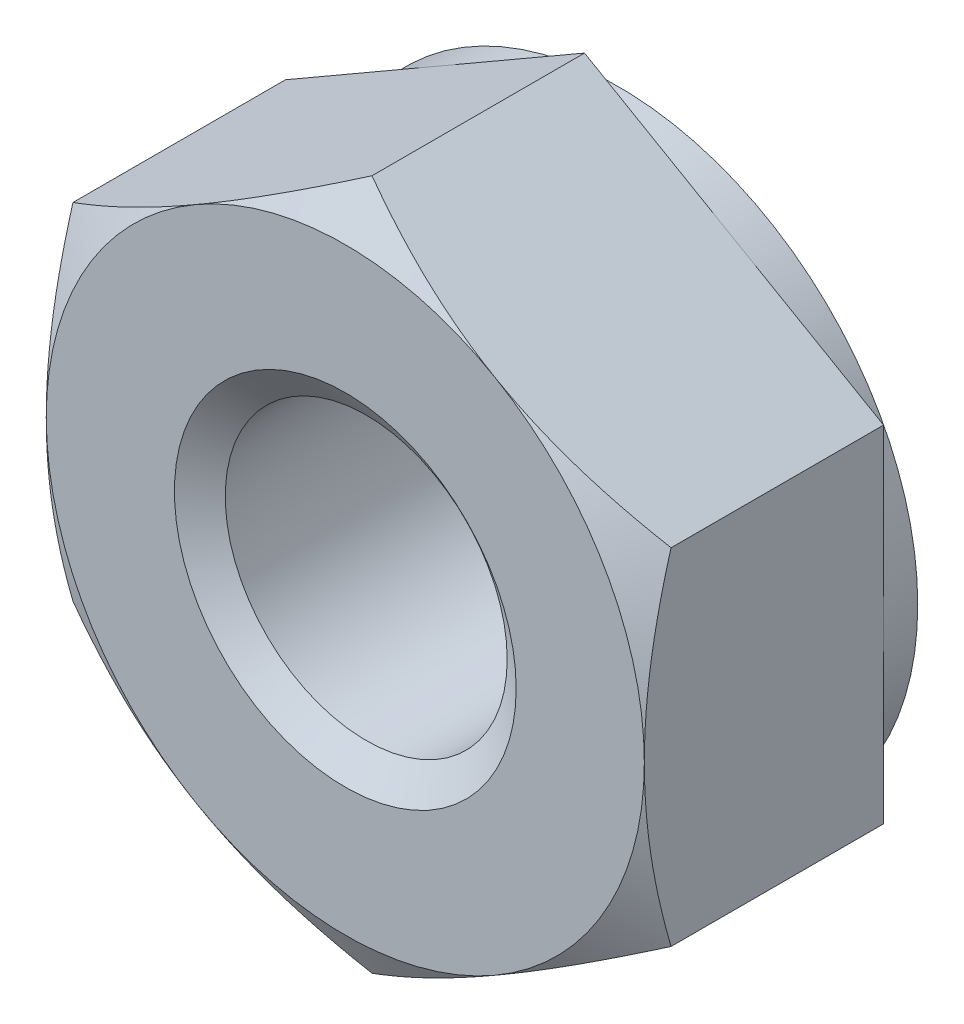
ISO-10303-21;
HEADER;
FILE_DESCRIPTION(('STEP AP214'),'2;1');
FILE_NAME('part.step','',(''),(''),'','','');
FILE_SCHEMA(('AUTOMOTIVE_DESIGN { 1 0 10303 214 1 1 1 1 }'));
ENDSEC;
DATA;
#1=APPLICATION_CONTEXT('core data for automotive mechanical design processes');
#2=APPLICATION_PROTOCOL_DEFINITION('international standard','automotive_design',2000,#1);
#3=PRODUCT_CONTEXT('',#1,'mechanical');
#4=PRODUCT('Part','Part','',(#3));
#5=PRODUCT_RELATED_PRODUCT_CATEGORY('part','',(#4));
#6=PRODUCT_DEFINITION_FORMATION('','',#4);
#7=PRODUCT_DEFINITION_CONTEXT('part definition',#1,'design');
#8=PRODUCT_DEFINITION('design','',#6,#7);
#9=PRODUCT_DEFINITION_SHAPE('','',#8);
#10=(LENGTH_UNIT() NAMED_UNIT(*) SI_UNIT(.MILLI.,.METRE.));
#11=(NAMED_UNIT(*) PLANE_ANGLE_UNIT() SI_UNIT($,.RADIAN.));
#12=(NAMED_UNIT(*) SI_UNIT($,.STERADIAN.) SOLID_ANGLE_UNIT());
#13=UNCERTAINTY_MEASURE_WITH_UNIT(LENGTH_MEASURE(1.E-05),#10,'distance_accuracy_value','');
#14=(GEOMETRIC_REPRESENTATION_CONTEXT(3) GLOBAL_UNCERTAINTY_ASSIGNED_CONTEXT((#13)) GLOBAL_UNIT_ASSIGNED_CONTEXT((#10,
#11,#12)) REPRESENTATION_CONTEXT('',''));
#15=CARTESIAN_POINT('',(0.,0.,0.));
#16=DIRECTION('',(0.,0.,1.));
#17=DIRECTION('',(1.,0.,0.));
#18=AXIS2_PLACEMENT_3D('',#15,#16,#17);
#19=CARTESIAN_POINT('',(0.,0.,-3.2));
#20=DIRECTION('',(0.,0.,1.));
#21=DIRECTION('',(1.,0.,0.));
#22=AXIS2_PLACEMENT_3D('',#19,#20,#21);
#23=CYLINDRICAL_SURFACE('',#22,1.65);
#24=CARTESIAN_POINT('',(0.,0.,-0.245072638373399));
#25=DIRECTION('',(0.,0.,1.));
#26=DIRECTION('',(1.,0.,0.));
#27=AXIS2_PLACEMENT_3D('',#24,#25,#26);
#28=CIRCLE('',#27,1.65);
#29=CARTESIAN_POINT('',(1.65,0.,-0.245072638373399));
#30=VERTEX_POINT('',#29);
#31=EDGE_CURVE('E155',#30,#30,#28,.F.);
#32=ORIENTED_EDGE('',*,*,#31,.F.);
#33=EDGE_LOOP('',(#32));
#34=FACE_BOUND('',#33,.T.);
#35=CARTESIAN_POINT('',(0.,0.,-2.9295273616266));
#36=DIRECTION('',(0.,0.,-1.));
#37=DIRECTION('',(-1.,0.,0.));
#38=AXIS2_PLACEMENT_3D('',#35,#36,#37);
#39=CIRCLE('',#38,1.65);
#40=CARTESIAN_POINT('',(-1.65,0.,-2.9295273616266));
#41=VERTEX_POINT('',#40);
#42=EDGE_CURVE('E43',#41,#41,#39,.F.);
#43=ORIENTED_EDGE('',*,*,#42,.F.);
#44=EDGE_LOOP('',(#43));
#45=FACE_BOUND('',#44,.T.);
#46=ADVANCED_FACE('F38',(#34,#45),#23,.F.);
#47=CARTESIAN_POINT('',(0.,4.04145188432738,-3.2));
#48=DIRECTION('',(-0.500000000000001,0.866025403784438,0.));
#49=DIRECTION('',(-0.866025403784438,-0.500000000000001,0.));
#50=AXIS2_PLACEMENT_3D('',#47,#48,#49);
#51=PLANE('',#50);
#52=DIRECTION('',(0.,0.,1.));
#53=VECTOR('',#52,1.);
#54=CARTESIAN_POINT('',(-3.5,2.02072594216369,-3.2));
#55=LINE('',#54,#53);
#56=CARTESIAN_POINT('',(-3.5,2.02072594216369,-2.8));
#57=VERTEX_POINT('',#56);
#58=CARTESIAN_POINT('',(-3.5,2.02072594216369,-0.312607391169646));
#59=VERTEX_POINT('',#58);
#60=EDGE_CURVE('E290',#57,#59,#55,.T.);
#61=ORIENTED_EDGE('',*,*,#60,.T.);
#62=CARTESIAN_POINT('',(-3.5002,2.02061047210985,-0.312674060693372));
#63=CARTESIAN_POINT('',(-3.34639282154755,2.10941108799267,-0.261385788989984));
#64=CARTESIAN_POINT('',(-3.19125798916558,2.19897822522909,-0.214740953816197));
#65=CARTESIAN_POINT('',(-2.87830199342322,2.37966345361545,-0.133321875533349));
#66=CARTESIAN_POINT('',(-2.7204752692125,2.47078475532382,-0.0985764355845612));
#67=CARTESIAN_POINT('',(-2.40677778961987,2.65189807961073,-0.0444900271828357));
#68=CARTESIAN_POINT('',(-2.25095530083931,2.74186223545399,-0.0247890862603812));
#69=CARTESIAN_POINT('',(-1.93857711279463,2.92221386641056,-0.00127013273725415));
#70=CARTESIAN_POINT('',(-1.78202254896577,3.01260068598001,0.00256735545443494));
#71=CARTESIAN_POINT('',(-1.48949078007901,3.1814939814933,-0.00541530187697763));
#72=CARTESIAN_POINT('',(-1.35346978754209,3.26002573814993,-0.0152754340696072));
#73=CARTESIAN_POINT('',(-1.08231397971101,3.41657761679354,-0.046526466899404));
#74=CARTESIAN_POINT('',(-0.947180102315317,3.49459719728458,-0.0679280432857989));
#75=CARTESIAN_POINT('',(-0.675465207594816,3.65147186489429,-0.121430407880578));
#76=CARTESIAN_POINT('',(-0.538918580721664,3.73030709667644,-0.153757994445088));
#77=CARTESIAN_POINT('',(-0.267861907055498,3.88680174018324,-0.227128933807996));
#78=CARTESIAN_POINT('',(-0.133348387531463,3.96446315689009,-0.268155046569869));
#79=CARTESIAN_POINT('',(0.000200000000000957,4.04156735438122,-0.312674060693374));
#80=B_SPLINE_CURVE_WITH_KNOTS('',3,(#62,#63,#64,#65,#66,#67,#68,#69,#70,#71,#72,#73,#74,#75,#76,
#77,#78,#79),.UNSPECIFIED.,.F.,.F.,(4,2,2,2,2,2,2,2,4),(0.,0.554793832886254,1.11092123814984,
1.65328467083219,2.19498204478403,2.6666513085086,3.13875761298267,3.6213361260051,
4.10296698719187),.UNSPECIFIED.);
#81=CARTESIAN_POINT('',(-1.75,3.03108891324553,0.));
#82=VERTEX_POINT('',#81);
#83=EDGE_CURVE('E62',#59,#82,#80,.T.);
#84=ORIENTED_EDGE('',*,*,#83,.T.);
#85=CARTESIAN_POINT('',(0.,4.04145188432738,-0.312607391169646));
#86=VERTEX_POINT('',#85);
#87=EDGE_CURVE('E169',#82,#86,#80,.T.);
#88=ORIENTED_EDGE('',*,*,#87,.T.);
#89=DIRECTION('',(0.,0.,1.));
#90=VECTOR('',#89,1.);
#91=CARTESIAN_POINT('',(0.,4.04145188432738,-3.2));
#92=LINE('',#91,#90);
#93=CARTESIAN_POINT('',(0.,4.04145188432738,-2.8));
#94=VERTEX_POINT('',#93);
#95=EDGE_CURVE('E278',#94,#86,#92,.T.);
#96=ORIENTED_EDGE('',*,*,#95,.F.);
#97=DIRECTION('',(-0.866025403784438,-0.500000000000001,0.));
#98=VECTOR('',#97,1.);
#99=CARTESIAN_POINT('',(0.,4.04145188432738,-2.8));
#100=LINE('',#99,#98);
#101=CARTESIAN_POINT('',(-1.75,3.03108891324553,-2.8));
#102=VERTEX_POINT('',#101);
#103=EDGE_CURVE('E266',#94,#102,#100,.T.);
#104=ORIENTED_EDGE('',*,*,#103,.T.);
#105=EDGE_CURVE('E262',#102,#57,#100,.T.);
#106=ORIENTED_EDGE('',*,*,#105,.T.);
#107=EDGE_LOOP('',(#61,#84,#88,#96,#104,#106));
#108=FACE_BOUND('',#107,.T.);
#109=ADVANCED_FACE('F40',(#108),#51,.T.);
#110=CARTESIAN_POINT('',(3.5,2.02072594216369,-3.2));
#111=DIRECTION('',(0.500000000000001,0.866025403784438,0.));
#112=DIRECTION('',(-0.866025403784438,0.500000000000001,0.));
#113=AXIS2_PLACEMENT_3D('',#110,#111,#112);
#114=PLANE('',#113);
#115=ORIENTED_EDGE('',*,*,#95,.T.);
#116=CARTESIAN_POINT('',(-0.000199999999999582,4.04156735438122,-0.312674060693374));
#117=CARTESIAN_POINT('',(0.15360717845245,3.9527667384984,-0.261385788989986));
#118=CARTESIAN_POINT('',(0.308742010834424,3.86319960126198,-0.214740953816199));
#119=CARTESIAN_POINT('',(0.621698006576782,3.68251437287562,-0.13332187553335));
#120=CARTESIAN_POINT('',(0.779524730787497,3.59139307116725,-0.0985764355845622));
#121=CARTESIAN_POINT('',(1.09322221038013,3.41027974688034,-0.0444900271828364));
#122=CARTESIAN_POINT('',(1.24904469916069,3.32031559103708,-0.0247890862603816));
#123=CARTESIAN_POINT('',(1.56142288720538,3.13996396008051,-0.00127013273725405));
#124=CARTESIAN_POINT('',(1.71797745103423,3.04957714051106,0.00256735545443515));
#125=CARTESIAN_POINT('',(2.01050921992099,2.88068384499777,-0.00541530187697721));
#126=CARTESIAN_POINT('',(2.14653021245791,2.80215208834114,-0.0152754340696066));
#127=CARTESIAN_POINT('',(2.417686020289,2.64560020969753,-0.0465264668994031));
#128=CARTESIAN_POINT('',(2.55281989768468,2.56758062920649,-0.0679280432857977));
#129=CARTESIAN_POINT('',(2.82453479240518,2.41070596159678,-0.121430407880577));
#130=CARTESIAN_POINT('',(2.96108141927834,2.33187072981463,-0.153757994445087));
#131=CARTESIAN_POINT('',(3.2321380929445,2.17537608630783,-0.227128933807994));
#132=CARTESIAN_POINT('',(3.36665161246854,2.09771466960098,-0.268155046569867));
#133=CARTESIAN_POINT('',(3.5002,2.02061047210985,-0.312674060693371));
#134=B_SPLINE_CURVE_WITH_KNOTS('',3,(#116,#117,#118,#119,#120,#121,#122,#123,#124,#125,#126,
#127,#128,#129,#130,#131,#132,#133),.UNSPECIFIED.,.F.,.F.,(4,2,2,2,2,2,2,2,4),(0.,
0.554793832886254,1.11092123814984,1.65328467083219,2.19498204478403,2.6666513085086,
3.13875761298267,3.6213361260051,4.10296698719187),.UNSPECIFIED.);
#135=CARTESIAN_POINT('',(1.75,3.03108891324553,0.));
#136=VERTEX_POINT('',#135);
#137=EDGE_CURVE('E166',#86,#136,#134,.T.);
#138=ORIENTED_EDGE('',*,*,#137,.T.);
#139=CARTESIAN_POINT('',(3.5,2.02072594216369,-0.312607391169646));
#140=VERTEX_POINT('',#139);
#141=EDGE_CURVE('E149',#136,#140,#134,.T.);
#142=ORIENTED_EDGE('',*,*,#141,.T.);
#143=DIRECTION('',(0.,0.,1.));
#144=VECTOR('',#143,1.);
#145=CARTESIAN_POINT('',(3.5,2.02072594216369,-3.2));
#146=LINE('',#145,#144);
#147=CARTESIAN_POINT('',(3.5,2.02072594216369,-2.8));
#148=VERTEX_POINT('',#147);
#149=EDGE_CURVE('E165',#148,#140,#146,.T.);
#150=ORIENTED_EDGE('',*,*,#149,.F.);
#151=DIRECTION('',(-0.866025403784438,0.500000000000001,0.));
#152=VECTOR('',#151,1.);
#153=CARTESIAN_POINT('',(3.5,2.02072594216369,-2.8));
#154=LINE('',#153,#152);
#155=CARTESIAN_POINT('',(1.75,3.03108891324553,-2.8));
#156=VERTEX_POINT('',#155);
#157=EDGE_CURVE('E274',#148,#156,#154,.T.);
#158=ORIENTED_EDGE('',*,*,#157,.T.);
#159=EDGE_CURVE('E270',#156,#94,#154,.T.);
#160=ORIENTED_EDGE('',*,*,#159,.T.);
#161=EDGE_LOOP('',(#115,#138,#142,#150,#158,#160));
#162=FACE_BOUND('',#161,.T.);
#163=ADVANCED_FACE('F238',(#162),#114,.T.);
#164=CARTESIAN_POINT('',(3.5,2.02072594216369,-3.2));
#165=DIRECTION('',(-1.,0.,0.));
#166=DIRECTION('',(0.,0.,1.));
#167=AXIS2_PLACEMENT_3D('',#164,#165,#166);
#168=PLANE('',#167);
#169=CARTESIAN_POINT('',(3.5,-5.35926299121406,-1.67484346858556));
#170=CARTESIAN_POINT('',(3.5,-5.20559319908842,-1.60058173692104));
#171=CARTESIAN_POINT('',(3.5,-5.05156008083376,-1.52705822833148));
#172=CARTESIAN_POINT('',(3.5,-4.7425707418071,-1.38190950344752));
#173=CARTESIAN_POINT('',(3.5,-4.58761436682437,-1.31028461582133));
#174=CARTESIAN_POINT('',(3.5,-4.27574500225542,-1.16897765517624));
#175=CARTESIAN_POINT('',(3.5,-4.11882589028192,-1.09930904568016));
#176=CARTESIAN_POINT('',(3.5,-3.80369792903856,-0.962964262242763));
#177=CARTESIAN_POINT('',(3.5,-3.64548914750596,-0.896287932319521));
#178=CARTESIAN_POINT('',(3.5,-3.32556618401855,-0.765931819095069));
#179=CARTESIAN_POINT('',(3.5,-3.16383281219924,-0.702298873688867));
#180=CARTESIAN_POINT('',(3.5,-2.83845840945598,-0.580016702089494));
#181=CARTESIAN_POINT('',(3.5,-2.67481716858826,-0.521368030370693));
#182=CARTESIAN_POINT('',(3.5,-2.34570278472049,-0.410630279877023));
#183=CARTESIAN_POINT('',(3.5,-2.18023438248743,-0.358527255435859));
#184=CARTESIAN_POINT('',(3.5,-1.8469452280637,-0.262572936976444));
#185=CARTESIAN_POINT('',(3.5,-1.6791252378753,-0.218719033467159));
#186=CARTESIAN_POINT('',(3.5,-1.34101828610925,-0.141391945584787));
#187=CARTESIAN_POINT('',(3.5,-1.17073068027693,-0.107921525211973));
#188=CARTESIAN_POINT('',(3.5,-0.828102385138485,-0.0536149564320507));
#189=CARTESIAN_POINT('',(3.5,-0.655761694017303,-0.0327788191952368));
#190=CARTESIAN_POINT('',(3.5,-0.31102049092445,-0.0055840865057568));
#191=CARTESIAN_POINT('',(3.5,-0.13862739720726,0.000866163165911258));
#192=CARTESIAN_POINT('',(3.5,0.206038074906535,-0.00105355807794609));
#193=CARTESIAN_POINT('',(3.5,0.378310473023179,-0.00941968196343193));
#194=CARTESIAN_POINT('',(3.5,0.672490555822326,-0.0357688927868922));
#195=CARTESIAN_POINT('',(3.5,0.794722791084091,-0.0503206340384215));
#196=CARTESIAN_POINT('',(3.5,1.0382430543056,-0.0859367340533558));
#197=CARTESIAN_POINT('',(3.5,1.15953093025886,-0.107002119926141));
#198=CARTESIAN_POINT('',(3.5,1.52187914771348,-0.178863187081452));
#199=CARTESIAN_POINT('',(3.5,1.76124104212632,-0.23830527562201));
#200=CARTESIAN_POINT('',(3.5,2.11940971387708,-0.340826814402554));
#201=CARTESIAN_POINT('',(3.5,2.24008344316346,-0.377749699085183));
#202=CARTESIAN_POINT('',(3.5,2.48017139213728,-0.455249007699293));
#203=CARTESIAN_POINT('',(3.5,2.59958641795613,-0.495822911663549));
#204=CARTESIAN_POINT('',(3.5,2.83665760451798,-0.579779986782752));
#205=CARTESIAN_POINT('',(3.5,2.95431988203483,-0.623146060034314));
#206=CARTESIAN_POINT('',(3.5,3.188731535088,-0.712423559566865));
#207=CARTESIAN_POINT('',(3.5,3.30548051959464,-0.758336014592949));
#208=CARTESIAN_POINT('',(3.5,3.42180736613348,-0.80527038072407));
#209=B_SPLINE_CURVE_WITH_KNOTS('',3,(#169,#170,#171,#172,#173,#174,#175,#176,#177,#178,#179,
#180,#181,#182,#183,#184,#185,#186,#187,#188,#189,#190,#191,#192,#193,#194,#195,#196,#197,#198,
#199,#200,#201,#202,#203,#204,#205,#206,#207,#208),.UNSPECIFIED.,.F.,.F.,(4,2,2,2,2,2,2,2,2,2,2,
2,2,2,2,2,2,2,2,4),(0.,0.512025318465737,1.02413870177436,1.53918270315241,2.05419982499223,
2.57553975872798,3.09693761309353,3.61720506610401,4.13730766217537,4.65754858684365,
5.17778997146961,5.69470725122282,6.21149033452401,6.58059623222331,6.94976036239485,
7.68863804939851,8.06719621660478,8.44549507476761,8.82166461280099,9.1979872473341),.UNSPECIFIED.);
#210=CARTESIAN_POINT('',(3.5,-2.0207259421637,-0.312607391169646));
#211=VERTEX_POINT('',#210);
#212=CARTESIAN_POINT('',(3.5,0.,0.));
#213=VERTEX_POINT('',#212);
#214=EDGE_CURVE('E130',#211,#213,#209,.T.);
#215=ORIENTED_EDGE('',*,*,#214,.F.);
#216=DIRECTION('',(0.,0.,1.));
#217=VECTOR('',#216,1.);
#218=CARTESIAN_POINT('',(3.5,-2.0207259421637,-3.2));
#219=LINE('',#218,#217);
#220=CARTESIAN_POINT('',(3.5,-2.0207259421637,-2.8));
#221=VERTEX_POINT('',#220);
#222=EDGE_CURVE('E283',#221,#211,#219,.T.);
#223=ORIENTED_EDGE('',*,*,#222,.F.);
#224=DIRECTION('',(0.,-1.,0.));
#225=VECTOR('',#224,1.);
#226=CARTESIAN_POINT('',(3.5,2.02072594216369,-2.8));
#227=LINE('',#226,#225);
#228=CARTESIAN_POINT('',(3.5,0.,-2.8));
#229=VERTEX_POINT('',#228);
#230=EDGE_CURVE('E275',#229,#221,#227,.T.);
#231=ORIENTED_EDGE('',*,*,#230,.F.);
#232=EDGE_CURVE('E277',#148,#229,#227,.T.);
#233=ORIENTED_EDGE('',*,*,#232,.F.);
#234=ORIENTED_EDGE('',*,*,#149,.T.);
#235=EDGE_CURVE('E143',#213,#140,#209,.T.);
#236=ORIENTED_EDGE('',*,*,#235,.F.);
#237=EDGE_LOOP('',(#215,#223,#231,#233,#234,#236));
#238=FACE_BOUND('',#237,.T.);
#239=ADVANCED_FACE('F162',(#238),#168,.F.);
#240=CARTESIAN_POINT('',(0.,-4.04145188432739,-3.2));
#241=DIRECTION('',(0.500000000000001,-0.866025403784438,0.));
#242=DIRECTION('',(0.866025403784438,0.500000000000001,0.));
#243=AXIS2_PLACEMENT_3D('',#240,#241,#242);
#244=PLANE('',#243);
#245=ORIENTED_EDGE('',*,*,#222,.T.);
#246=CARTESIAN_POINT('',(3.5002,-2.02061047210986,-0.312674060693374));
#247=CARTESIAN_POINT('',(3.34639282154755,-2.10941108799268,-0.261385788989986));
#248=CARTESIAN_POINT('',(3.19125798916558,-2.1989782252291,-0.214740953816199));
#249=CARTESIAN_POINT('',(2.87830199342322,-2.37966345361545,-0.133321875533351));
#250=CARTESIAN_POINT('',(2.7204752692125,-2.47078475532383,-0.0985764355845636));
#251=CARTESIAN_POINT('',(2.40677778961987,-2.65189807961074,-0.0444900271828383));
#252=CARTESIAN_POINT('',(2.25095530083931,-2.741862235454,-0.0247890862603838));
#253=CARTESIAN_POINT('',(1.93857711279462,-2.92221386641056,-0.00127013273725686));
#254=CARTESIAN_POINT('',(1.78202254896577,-3.01260068598002,0.00256735545443198));
#255=CARTESIAN_POINT('',(1.48949078007901,-3.18149398149331,-0.00541530187698112));
#256=CARTESIAN_POINT('',(1.35346978754209,-3.26002573814994,-0.0152754340696109));
#257=CARTESIAN_POINT('',(1.082313979711,-3.41657761679354,-0.0465264668994078));
#258=CARTESIAN_POINT('',(0.947180102315316,-3.49459719728458,-0.0679280432858026));
#259=CARTESIAN_POINT('',(0.675465207594815,-3.6514718648943,-0.121430407880582));
#260=CARTESIAN_POINT('',(0.538918580721663,-3.73030709667644,-0.153757994445092));
#261=CARTESIAN_POINT('',(0.267861907055497,-3.88680174018325,-0.227128933808));
#262=CARTESIAN_POINT('',(0.133348387531463,-3.9644631568901,-0.268155046569873));
#263=CARTESIAN_POINT('',(-0.000200000000000254,-4.04156735438123,-0.312674060693377));
#264=B_SPLINE_CURVE_WITH_KNOTS('',3,(#246,#247,#248,#249,#250,#251,#252,#253,#254,#255,#256,
#257,#258,#259,#260,#261,#262,#263),.UNSPECIFIED.,.F.,.F.,(4,2,2,2,2,2,2,2,4),(0.,
0.554793832886255,1.11092123814984,1.65328467083219,2.19498204478403,2.6666513085086,
3.13875761298268,3.6213361260051,4.10296698719187),.UNSPECIFIED.);
#265=CARTESIAN_POINT('',(1.75,-3.03108891324553,0.));
#266=VERTEX_POINT('',#265);
#267=EDGE_CURVE('E137',#211,#266,#264,.T.);
#268=ORIENTED_EDGE('',*,*,#267,.T.);
#269=CARTESIAN_POINT('',(0.,-4.04145188432738,-0.312607391169646));
#270=VERTEX_POINT('',#269);
#271=EDGE_CURVE('E176',#266,#270,#264,.T.);
#272=ORIENTED_EDGE('',*,*,#271,.T.);
#273=DIRECTION('',(0.,0.,1.));
#274=VECTOR('',#273,1.);
#275=CARTESIAN_POINT('',(0.,-4.04145188432739,-3.2));
#276=LINE('',#275,#274);
#277=CARTESIAN_POINT('',(0.,-4.04145188432739,-2.8));
#278=VERTEX_POINT('',#277);
#279=EDGE_CURVE('E285',#278,#270,#276,.T.);
#280=ORIENTED_EDGE('',*,*,#279,.F.);
#281=DIRECTION('',(0.866025403784438,0.500000000000001,0.));
#282=VECTOR('',#281,1.);
#283=CARTESIAN_POINT('',(0.,-4.04145188432739,-2.8));
#284=LINE('',#283,#282);
#285=CARTESIAN_POINT('',(1.75000000000001,-3.03108891324554,-2.8));
#286=VERTEX_POINT('',#285);
#287=EDGE_CURVE('E267',#278,#286,#284,.T.);
#288=ORIENTED_EDGE('',*,*,#287,.T.);
#289=EDGE_CURVE('E271',#286,#221,#284,.T.);
#290=ORIENTED_EDGE('',*,*,#289,.T.);
#291=EDGE_LOOP('',(#245,#268,#272,#280,#288,#290));
#292=FACE_BOUND('',#291,.T.);
#293=ADVANCED_FACE('F219',(#292),#244,.T.);
#294=CARTESIAN_POINT('',(-3.5,-2.02072594216369,-3.2));
#295=DIRECTION('',(-0.500000000000001,-0.866025403784438,0.));
#296=DIRECTION('',(0.866025403784438,-0.500000000000001,0.));
#297=AXIS2_PLACEMENT_3D('',#294,#295,#296);
#298=PLANE('',#297);
#299=ORIENTED_EDGE('',*,*,#279,.T.);
#300=CARTESIAN_POINT('',(0.000199999999999624,-4.04156735438123,-0.312674060693377));
#301=CARTESIAN_POINT('',(-0.15360717845245,-3.95276673849841,-0.261385788989989));
#302=CARTESIAN_POINT('',(-0.308742010834425,-3.86319960126199,-0.214740953816202));
#303=CARTESIAN_POINT('',(-0.621698006576783,-3.68251437287563,-0.133321875533353));
#304=CARTESIAN_POINT('',(-0.779524730787498,-3.59139307116726,-0.0985764355845654));
#305=CARTESIAN_POINT('',(-1.09322221038013,-3.41027974688034,-0.0444900271828395));
#306=CARTESIAN_POINT('',(-1.24904469916069,-3.32031559103708,-0.0247890862603848));
#307=CARTESIAN_POINT('',(-1.56142288720538,-3.13996396008052,-0.00127013273725731));
#308=CARTESIAN_POINT('',(-1.71797745103423,-3.04957714051106,0.00256735545443195));
#309=CARTESIAN_POINT('',(-2.01050921992099,-2.88068384499778,-0.0054153018769805));
#310=CARTESIAN_POINT('',(-2.14653021245791,-2.80215208834115,-0.01527543406961));
#311=CARTESIAN_POINT('',(-2.417686020289,-2.64560020969754,-0.0465264668994063));
#312=CARTESIAN_POINT('',(-2.55281989768469,-2.5675806292065,-0.0679280432858008));
#313=CARTESIAN_POINT('',(-2.82453479240519,-2.41070596159679,-0.121430407880579));
#314=CARTESIAN_POINT('',(-2.96108141927834,-2.33187072981464,-0.153757994445089));
#315=CARTESIAN_POINT('',(-3.2321380929445,-2.17537608630783,-0.227128933807996));
#316=CARTESIAN_POINT('',(-3.36665161246854,-2.09771466960099,-0.268155046569869));
#317=CARTESIAN_POINT('',(-3.5002,-2.02061047210986,-0.312674060693373));
#318=B_SPLINE_CURVE_WITH_KNOTS('',3,(#300,#301,#302,#303,#304,#305,#306,#307,#308,#309,#310,
#311,#312,#313,#314,#315,#316,#317),.UNSPECIFIED.,.F.,.F.,(4,2,2,2,2,2,2,2,4),(0.,
0.554793832886255,1.11092123814984,1.65328467083219,2.19498204478404,2.6666513085086,
3.13875761298268,3.6213361260051,4.10296698719187),.UNSPECIFIED.);
#319=CARTESIAN_POINT('',(-1.75,-3.03108891324553,0.));
#320=VERTEX_POINT('',#319);
#321=EDGE_CURVE('E213',#270,#320,#318,.T.);
#322=ORIENTED_EDGE('',*,*,#321,.T.);
#323=CARTESIAN_POINT('',(-3.5,-2.02072594216369,-0.312607391169646));
#324=VERTEX_POINT('',#323);
#325=EDGE_CURVE('E206',#320,#324,#318,.T.);
#326=ORIENTED_EDGE('',*,*,#325,.T.);
#327=DIRECTION('',(0.,0.,1.));
#328=VECTOR('',#327,1.);
#329=CARTESIAN_POINT('',(-3.5,-2.02072594216369,-3.2));
#330=LINE('',#329,#328);
#331=CARTESIAN_POINT('',(-3.5,-2.02072594216369,-2.8));
#332=VERTEX_POINT('',#331);
#333=EDGE_CURVE('E288',#332,#324,#330,.T.);
#334=ORIENTED_EDGE('',*,*,#333,.F.);
#335=DIRECTION('',(0.866025403784438,-0.500000000000001,0.));
#336=VECTOR('',#335,1.);
#337=CARTESIAN_POINT('',(-3.5,-2.02072594216369,-2.8));
#338=LINE('',#337,#336);
#339=CARTESIAN_POINT('',(-1.75000000000001,-3.03108891324554,-2.8));
#340=VERTEX_POINT('',#339);
#341=EDGE_CURVE('E257',#332,#340,#338,.T.);
#342=ORIENTED_EDGE('',*,*,#341,.T.);
#343=EDGE_CURVE('E263',#340,#278,#338,.T.);
#344=ORIENTED_EDGE('',*,*,#343,.T.);
#345=EDGE_LOOP('',(#299,#322,#326,#334,#342,#344));
#346=FACE_BOUND('',#345,.T.);
#347=ADVANCED_FACE('F215',(#346),#298,.T.);
#348=CARTESIAN_POINT('',(-3.5,2.02072594216369,-3.2));
#349=DIRECTION('',(-1.,0.,0.));
#350=DIRECTION('',(0.,0.,1.));
#351=AXIS2_PLACEMENT_3D('',#348,#349,#350);
#352=PLANE('',#351);
#353=ORIENTED_EDGE('',*,*,#333,.T.);
#354=CARTESIAN_POINT('',(-3.5,-5.35926299121406,-1.67484346858556));
#355=CARTESIAN_POINT('',(-3.5,-5.20559319908842,-1.60058173692104));
#356=CARTESIAN_POINT('',(-3.5,-5.05156008083375,-1.52705822833148));
#357=CARTESIAN_POINT('',(-3.5,-4.7425707418071,-1.38190950344752));
#358=CARTESIAN_POINT('',(-3.5,-4.58761436682437,-1.31028461582133));
#359=CARTESIAN_POINT('',(-3.5,-4.27574500225542,-1.16897765517624));
#360=CARTESIAN_POINT('',(-3.5,-4.11882589028192,-1.09930904568016));
#361=CARTESIAN_POINT('',(-3.5,-3.80369792903855,-0.962964262242763));
#362=CARTESIAN_POINT('',(-3.5,-3.64548914750595,-0.89628793231952));
#363=CARTESIAN_POINT('',(-3.5,-3.32556618401855,-0.765931819095068));
#364=CARTESIAN_POINT('',(-3.5,-3.16383281219924,-0.702298873688866));
#365=CARTESIAN_POINT('',(-3.5,-2.83845840945597,-0.580016702089493));
#366=CARTESIAN_POINT('',(-3.5,-2.67481716858826,-0.521368030370692));
#367=CARTESIAN_POINT('',(-3.5,-2.34570278472049,-0.410630279877022));
#368=CARTESIAN_POINT('',(-3.5,-2.18023438248742,-0.358527255435858));
#369=CARTESIAN_POINT('',(-3.5,-1.8469452280637,-0.262572936976443));
#370=CARTESIAN_POINT('',(-3.5,-1.6791252378753,-0.218719033467158));
#371=CARTESIAN_POINT('',(-3.5,-1.34101828610925,-0.141391945584787));
#372=CARTESIAN_POINT('',(-3.5,-1.17073068027693,-0.107921525211973));
#373=CARTESIAN_POINT('',(-3.5,-0.828102385138484,-0.0536149564320504));
#374=CARTESIAN_POINT('',(-3.5,-0.655761694017301,-0.0327788191952365));
#375=CARTESIAN_POINT('',(-3.5,-0.311020490924449,-0.00558408650575661));
#376=CARTESIAN_POINT('',(-3.5,-0.138627397207259,0.00086616316591139));
#377=CARTESIAN_POINT('',(-3.5,0.206038074906536,-0.00105355807794622));
#378=CARTESIAN_POINT('',(-3.5,0.37831047302318,-0.00941968196343225));
#379=CARTESIAN_POINT('',(-3.5,0.672490555822327,-0.0357688927868924));
#380=CARTESIAN_POINT('',(-3.5,0.794722791084092,-0.0503206340384215));
#381=CARTESIAN_POINT('',(-3.5,1.0382430543056,-0.0859367340533558));
#382=CARTESIAN_POINT('',(-3.5,1.15953093025887,-0.107002119926141));
#383=CARTESIAN_POINT('',(-3.5,1.52187914771348,-0.178863187081453));
#384=CARTESIAN_POINT('',(-3.5,1.76124104212632,-0.23830527562201));
#385=CARTESIAN_POINT('',(-3.5,2.11940971387708,-0.340826814402554));
#386=CARTESIAN_POINT('',(-3.5,2.24008344316346,-0.377749699085183));
#387=CARTESIAN_POINT('',(-3.5,2.48017139213728,-0.455249007699293));
#388=CARTESIAN_POINT('',(-3.5,2.59958641795613,-0.49582291166355));
#389=CARTESIAN_POINT('',(-3.5,2.83665760451798,-0.579779986782752));
#390=CARTESIAN_POINT('',(-3.5,2.95431988203483,-0.623146060034314));
#391=CARTESIAN_POINT('',(-3.5,3.188731535088,-0.712423559566866));
#392=CARTESIAN_POINT('',(-3.5,3.30548051959464,-0.75833601459295));
#393=CARTESIAN_POINT('',(-3.5,3.42180736613349,-0.805270380724071));
#394=B_SPLINE_CURVE_WITH_KNOTS('',3,(#354,#355,#356,#357,#358,#359,#360,#361,#362,#363,#364,
#365,#366,#367,#368,#369,#370,#371,#372,#373,#374,#375,#376,#377,#378,#379,#380,#381,#382,#383,
#384,#385,#386,#387,#388,#389,#390,#391,#392,#393),.UNSPECIFIED.,.F.,.F.,(4,2,2,2,2,2,2,2,2,2,2,
2,2,2,2,2,2,2,2,4),(0.,0.512025318465737,1.02413870177436,1.53918270315241,2.05419982499223,
2.57553975872798,3.09693761309353,3.61720506610401,4.13730766217537,4.65754858684365,
5.17778997146961,5.69470725122282,6.21149033452401,6.58059623222331,6.94976036239485,
7.68863804939851,8.06719621660478,8.4454950747676,8.82166461280099,9.1979872473341),.UNSPECIFIED.);
#395=CARTESIAN_POINT('',(-3.5,0.,0.));
#396=VERTEX_POINT('',#395);
#397=EDGE_CURVE('E214',#324,#396,#394,.T.);
#398=ORIENTED_EDGE('',*,*,#397,.T.);
#399=EDGE_CURVE('E154',#396,#59,#394,.T.);
#400=ORIENTED_EDGE('',*,*,#399,.T.);
#401=ORIENTED_EDGE('',*,*,#60,.F.);
#402=DIRECTION('',(0.,-1.,0.));
#403=VECTOR('',#402,1.);
#404=CARTESIAN_POINT('',(-3.5,2.02072594216369,-2.8));
#405=LINE('',#404,#403);
#406=CARTESIAN_POINT('',(-3.5,0.,-2.8));
#407=VERTEX_POINT('',#406);
#408=EDGE_CURVE('E297',#57,#407,#405,.T.);
#409=ORIENTED_EDGE('',*,*,#408,.T.);
#410=EDGE_CURVE('E295',#407,#332,#405,.T.);
#411=ORIENTED_EDGE('',*,*,#410,.T.);
#412=EDGE_LOOP('',(#353,#398,#400,#401,#409,#411));
#413=FACE_BOUND('',#412,.T.);
#414=ADVANCED_FACE('F218',(#413),#352,.T.);
#415=CARTESIAN_POINT('',(0.,4.04145188432738,0.));
#416=DIRECTION('',(0.,0.,-1.));
#417=DIRECTION('',(-1.,0.,0.));
#418=AXIS2_PLACEMENT_3D('',#415,#416,#417);
#419=PLANE('',#418);
#420=CARTESIAN_POINT('',(0.,0.,0.));
#421=DIRECTION('',(0.,0.,1.));
#422=DIRECTION('',(1.,0.,0.));
#423=AXIS2_PLACEMENT_3D('',#420,#421,#422);
#424=CIRCLE('',#423,2.);
#425=CARTESIAN_POINT('',(2.,0.,0.));
#426=VERTEX_POINT('',#425);
#427=EDGE_CURVE('E300',#426,#426,#424,.T.);
#428=ORIENTED_EDGE('',*,*,#427,.F.);
#429=EDGE_LOOP('',(#428));
#430=FACE_BOUND('',#429,.T.);
#431=CARTESIAN_POINT('',(0.,0.,0.));
#432=DIRECTION('',(0.,0.,-1.));
#433=DIRECTION('',(-1.,0.,0.));
#434=AXIS2_PLACEMENT_3D('',#431,#432,#433);
#435=CIRCLE('',#434,3.5);
#436=EDGE_CURVE('E50',#82,#396,#435,.F.);
#437=ORIENTED_EDGE('',*,*,#436,.T.);
#438=EDGE_CURVE('E12',#396,#320,#435,.F.);
#439=ORIENTED_EDGE('',*,*,#438,.T.);
#440=EDGE_CURVE('E48',#320,#266,#435,.F.);
#441=ORIENTED_EDGE('',*,*,#440,.T.);
#442=EDGE_CURVE('E134',#266,#213,#435,.F.);
#443=ORIENTED_EDGE('',*,*,#442,.T.);
#444=CARTESIAN_POINT('',(0.,0.,0.));
#445=DIRECTION('',(0.,0.,1.));
#446=DIRECTION('',(1.,0.,0.));
#447=AXIS2_PLACEMENT_3D('',#444,#445,#446);
#448=CIRCLE('',#447,3.5);
#449=EDGE_CURVE('E146',#213,#136,#448,.T.);
#450=ORIENTED_EDGE('',*,*,#449,.T.);
#451=EDGE_CURVE('E160',#136,#82,#435,.F.);
#452=ORIENTED_EDGE('',*,*,#451,.T.);
#453=EDGE_LOOP('',(#437,#439,#441,#443,#450,#452));
#454=FACE_BOUND('',#453,.T.);
#455=ADVANCED_FACE('F158',(#430,#454),#419,.F.);
#456=CARTESIAN_POINT('',(0.,4.04145188432738,-3.2));
#457=DIRECTION('',(0.,0.,-1.));
#458=DIRECTION('',(-1.,0.,0.));
#459=AXIS2_PLACEMENT_3D('',#456,#457,#458);
#460=PLANE('',#459);
#461=CARTESIAN_POINT('',(0.,0.,-3.2));
#462=DIRECTION('',(0.,0.,-1.));
#463=DIRECTION('',(-1.,0.,0.));
#464=AXIS2_PLACEMENT_3D('',#461,#462,#463);
#465=CIRCLE('',#464,2.);
#466=CARTESIAN_POINT('',(-2.,0.,-3.2));
#467=VERTEX_POINT('',#466);
#468=EDGE_CURVE('E301',#467,#467,#465,.F.);
#469=ORIENTED_EDGE('',*,*,#468,.T.);
#470=EDGE_LOOP('',(#469));
#471=FACE_BOUND('',#470,.T.);
#472=CARTESIAN_POINT('',(0.,0.,-3.2));
#473=DIRECTION('',(0.,0.,-1.));
#474=DIRECTION('',(-1.,0.,0.));
#475=AXIS2_PLACEMENT_3D('',#472,#473,#474);
#476=CIRCLE('',#475,3.5);
#477=CARTESIAN_POINT('',(-3.5,0.,-3.2));
#478=VERTEX_POINT('',#477);
#479=EDGE_CURVE('E281',#478,#478,#476,.F.);
#480=ORIENTED_EDGE('',*,*,#479,.F.);
#481=EDGE_LOOP('',(#480));
#482=FACE_BOUND('',#481,.T.);
#483=ADVANCED_FACE('F228',(#471,#482),#460,.T.);
#484=CARTESIAN_POINT('',(0.,14.0414518843274,-2.8));
#485=DIRECTION('',(0.,0.,-1.));
#486=DIRECTION('',(-1.,0.,0.));
#487=AXIS2_PLACEMENT_3D('',#484,#485,#486);
#488=PLANE('',#487);
#489=ORIENTED_EDGE('',*,*,#232,.T.);
#490=CARTESIAN_POINT('',(0.,0.,-2.8));
#491=DIRECTION('',(0.,0.,1.));
#492=DIRECTION('',(1.,0.,0.));
#493=AXIS2_PLACEMENT_3D('',#490,#491,#492);
#494=CIRCLE('',#493,3.5);
#495=EDGE_CURVE('E254',#229,#156,#494,.T.);
#496=ORIENTED_EDGE('',*,*,#495,.T.);
#497=ORIENTED_EDGE('',*,*,#157,.F.);
#498=EDGE_LOOP('',(#489,#496,#497));
#499=FACE_BOUND('',#498,.T.);
#500=ADVANCED_FACE('F245',(#499),#488,.T.);
#501=ORIENTED_EDGE('',*,*,#230,.T.);
#502=ORIENTED_EDGE('',*,*,#289,.F.);
#503=EDGE_CURVE('E259',#286,#229,#494,.T.);
#504=ORIENTED_EDGE('',*,*,#503,.T.);
#505=EDGE_LOOP('',(#501,#502,#504));
#506=FACE_BOUND('',#505,.T.);
#507=ADVANCED_FACE('F447',(#506),#488,.T.);
#508=EDGE_CURVE('E258',#156,#102,#494,.T.);
#509=ORIENTED_EDGE('',*,*,#508,.T.);
#510=ORIENTED_EDGE('',*,*,#103,.F.);
#511=ORIENTED_EDGE('',*,*,#159,.F.);
#512=EDGE_LOOP('',(#509,#510,#511));
#513=FACE_BOUND('',#512,.T.);
#514=ADVANCED_FACE('F438',(#513),#488,.T.);
#515=ORIENTED_EDGE('',*,*,#343,.F.);
#516=EDGE_CURVE('E511',#340,#286,#494,.T.);
#517=ORIENTED_EDGE('',*,*,#516,.T.);
#518=ORIENTED_EDGE('',*,*,#287,.F.);
#519=EDGE_LOOP('',(#515,#517,#518));
#520=FACE_BOUND('',#519,.T.);
#521=ADVANCED_FACE('F429',(#520),#488,.T.);
#522=EDGE_CURVE('E525',#102,#407,#494,.T.);
#523=ORIENTED_EDGE('',*,*,#522,.T.);
#524=ORIENTED_EDGE('',*,*,#408,.F.);
#525=ORIENTED_EDGE('',*,*,#105,.F.);
#526=EDGE_LOOP('',(#523,#524,#525));
#527=FACE_BOUND('',#526,.T.);
#528=ADVANCED_FACE('F413',(#527),#488,.T.);
#529=CARTESIAN_POINT('',(0.,0.,0.));
#530=DIRECTION('',(0.,0.,1.));
#531=DIRECTION('',(1.,0.,0.));
#532=AXIS2_PLACEMENT_3D('',#529,#530,#531);
#533=CYLINDRICAL_SURFACE('',#532,3.5);
#534=ORIENTED_EDGE('',*,*,#479,.T.);
#535=EDGE_LOOP('',(#534));
#536=FACE_BOUND('',#535,.T.);
#537=ORIENTED_EDGE('',*,*,#508,.F.);
#538=ORIENTED_EDGE('',*,*,#495,.F.);
#539=ORIENTED_EDGE('',*,*,#503,.F.);
#540=ORIENTED_EDGE('',*,*,#516,.F.);
#541=EDGE_CURVE('E527',#407,#340,#494,.T.);
#542=ORIENTED_EDGE('',*,*,#541,.F.);
#543=ORIENTED_EDGE('',*,*,#522,.F.);
#544=EDGE_LOOP('',(#537,#538,#539,#540,#542,#543));
#545=FACE_BOUND('',#544,.T.);
#546=ADVANCED_FACE('F243',(#536,#545),#533,.T.);
#547=ORIENTED_EDGE('',*,*,#410,.F.);
#548=ORIENTED_EDGE('',*,*,#541,.T.);
#549=ORIENTED_EDGE('',*,*,#341,.F.);
#550=EDGE_LOOP('',(#547,#548,#549));
#551=FACE_BOUND('',#550,.T.);
#552=ADVANCED_FACE('F196',(#551),#488,.T.);
#553=CARTESIAN_POINT('',(0.,0.,0.));
#554=DIRECTION('',(0.,0.,-1.));
#555=DIRECTION('',(-1.,0.,0.));
#556=AXIS2_PLACEMENT_3D('',#553,#554,#555);
#557=CONICAL_SURFACE('',#556,3.5,1.0471975511966);
#558=ORIENTED_EDGE('',*,*,#399,.F.);
#559=ORIENTED_EDGE('',*,*,#436,.F.);
#560=ORIENTED_EDGE('',*,*,#83,.F.);
#561=EDGE_LOOP('',(#558,#559,#560));
#562=FACE_BOUND('',#561,.T.);
#563=ADVANCED_FACE('F375',(#562),#557,.T.);
#564=ORIENTED_EDGE('',*,*,#451,.F.);
#565=ORIENTED_EDGE('',*,*,#137,.F.);
#566=ORIENTED_EDGE('',*,*,#87,.F.);
#567=EDGE_LOOP('',(#564,#565,#566));
#568=FACE_BOUND('',#567,.T.);
#569=ADVANCED_FACE('F194',(#568),#557,.T.);
#570=ORIENTED_EDGE('',*,*,#449,.F.);
#571=ORIENTED_EDGE('',*,*,#235,.T.);
#572=ORIENTED_EDGE('',*,*,#141,.F.);
#573=EDGE_LOOP('',(#570,#571,#572));
#574=FACE_BOUND('',#573,.T.);
#575=ADVANCED_FACE('F147',(#574),#557,.T.);
#576=ORIENTED_EDGE('',*,*,#214,.T.);
#577=ORIENTED_EDGE('',*,*,#442,.F.);
#578=ORIENTED_EDGE('',*,*,#267,.F.);
#579=EDGE_LOOP('',(#576,#577,#578));
#580=FACE_BOUND('',#579,.T.);
#581=ADVANCED_FACE('F132',(#580),#557,.T.);
#582=ORIENTED_EDGE('',*,*,#440,.F.);
#583=ORIENTED_EDGE('',*,*,#321,.F.);
#584=ORIENTED_EDGE('',*,*,#271,.F.);
#585=EDGE_LOOP('',(#582,#583,#584));
#586=FACE_BOUND('',#585,.T.);
#587=ADVANCED_FACE('F193',(#586),#557,.T.);
#588=ORIENTED_EDGE('',*,*,#438,.F.);
#589=ORIENTED_EDGE('',*,*,#397,.F.);
#590=ORIENTED_EDGE('',*,*,#325,.F.);
#591=EDGE_LOOP('',(#588,#589,#590));
#592=FACE_BOUND('',#591,.T.);
#593=ADVANCED_FACE('F187',(#592),#557,.T.);
#594=CARTESIAN_POINT('',(0.,0.,-0.269579902210739));
#595=DIRECTION('',(0.,0.,1.));
#596=DIRECTION('',(1.,0.,0.));
#597=AXIS2_PLACEMENT_3D('',#594,#595,#596);
#598=CONICAL_SURFACE('',#597,1.615,0.95993108859688);
#599=ORIENTED_EDGE('',*,*,#427,.T.);
#600=EDGE_LOOP('',(#599));
#601=FACE_BOUND('',#600,.T.);
#602=ORIENTED_EDGE('',*,*,#31,.T.);
#603=EDGE_LOOP('',(#602));
#604=FACE_BOUND('',#603,.T.);
#605=ADVANCED_FACE('F192',(#601,#604),#598,.F.);
#606=CARTESIAN_POINT('',(0.,0.,-3.1746));
#607=DIRECTION('',(0.,0.,-1.));
#608=DIRECTION('',(-1.,0.,0.));
#609=AXIS2_PLACEMENT_3D('',#606,#607,#608);
#610=CONICAL_SURFACE('',#609,2.,0.95993108859688);
#611=CARTESIAN_POINT('',(0.,0.,-3.1746));
#612=DIRECTION('',(0.,0.,1.));
#613=DIRECTION('',(1.,0.,0.));
#614=AXIS2_PLACEMENT_3D('',#611,#612,#613);
#615=CIRCLE('',#614,2.);
#616=CARTESIAN_POINT('',(2.,0.,-3.1746));
#617=VERTEX_POINT('',#616);
#618=EDGE_CURVE('E303',#617,#617,#615,.T.);
#619=ORIENTED_EDGE('',*,*,#618,.F.);
#620=EDGE_LOOP('',(#619));
#621=FACE_BOUND('',#620,.T.);
#622=ORIENTED_EDGE('',*,*,#42,.T.);
#623=EDGE_LOOP('',(#622));
#624=FACE_BOUND('',#623,.T.);
#625=ADVANCED_FACE('F316',(#621,#624),#610,.F.);
#626=CARTESIAN_POINT('',(0.,0.,-25.0375057290932));
#627=DIRECTION('',(0.,0.,1.));
#628=DIRECTION('',(1.,0.,0.));
#629=AXIS2_PLACEMENT_3D('',#626,#627,#628);
#630=CYLINDRICAL_SURFACE('',#629,2.);
#631=ORIENTED_EDGE('',*,*,#468,.F.);
#632=EDGE_LOOP('',(#631));
#633=FACE_BOUND('',#632,.T.);
#634=ORIENTED_EDGE('',*,*,#618,.T.);
#635=EDGE_LOOP('',(#634));
#636=FACE_BOUND('',#635,.T.);
#637=ADVANCED_FACE('F320',(#633,#636),#630,.F.);
#638=CLOSED_SHELL('',(#46,#109,#163,#239,#293,#347,#414,#455,#483,#500,#507,#514,#521,#528,#546,
#552,#563,#569,#575,#581,#587,#593,#605,#625,#637));
#639=MANIFOLD_SOLID_BREP('B2',#638);
#640=ADVANCED_BREP_SHAPE_REPRESENTATION('',(#18,#639),#14);
#641=SHAPE_DEFINITION_REPRESENTATION(#9,#640);
ENDSEC;
END-ISO-10303-21;
